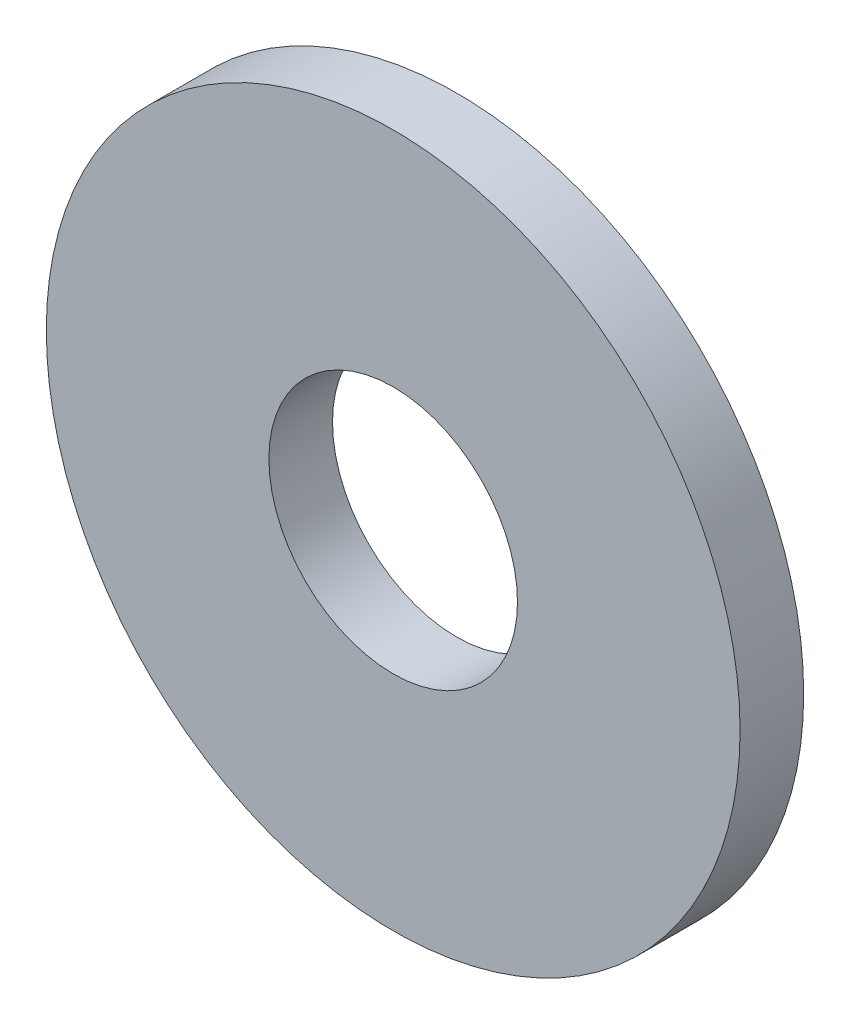
ISO-10303-21;
HEADER;
FILE_DESCRIPTION(('STEP AP214'),'2;1');
FILE_NAME('part.step','',(''),(''),'','','');
FILE_SCHEMA(('AUTOMOTIVE_DESIGN { 1 0 10303 214 1 1 1 1 }'));
ENDSEC;
DATA;
#1=APPLICATION_CONTEXT('core data for automotive mechanical design processes');
#2=APPLICATION_PROTOCOL_DEFINITION('international standard','automotive_design',2000,#1);
#3=PRODUCT_CONTEXT('',#1,'mechanical');
#4=PRODUCT('Part','Part','',(#3));
#5=PRODUCT_RELATED_PRODUCT_CATEGORY('part','',(#4));
#6=PRODUCT_DEFINITION_FORMATION('','',#4);
#7=PRODUCT_DEFINITION_CONTEXT('part definition',#1,'design');
#8=PRODUCT_DEFINITION('design','',#6,#7);
#9=PRODUCT_DEFINITION_SHAPE('','',#8);
#10=(LENGTH_UNIT() NAMED_UNIT(*) SI_UNIT(.MILLI.,.METRE.));
#11=(NAMED_UNIT(*) PLANE_ANGLE_UNIT() SI_UNIT($,.RADIAN.));
#12=(NAMED_UNIT(*) SI_UNIT($,.STERADIAN.) SOLID_ANGLE_UNIT());
#13=UNCERTAINTY_MEASURE_WITH_UNIT(LENGTH_MEASURE(1.E-05),#10,'distance_accuracy_value','');
#14=(GEOMETRIC_REPRESENTATION_CONTEXT(3) GLOBAL_UNCERTAINTY_ASSIGNED_CONTEXT((#13)) GLOBAL_UNIT_ASSIGNED_CONTEXT((#10,
#11,#12)) REPRESENTATION_CONTEXT('',''));
#15=CARTESIAN_POINT('',(0.,0.,0.));
#16=DIRECTION('',(0.,0.,1.));
#17=DIRECTION('',(1.,0.,0.));
#18=AXIS2_PLACEMENT_3D('',#15,#16,#17);
#19=CARTESIAN_POINT('',(0.,0.,1.1));
#20=DIRECTION('',(0.,0.,1.));
#21=DIRECTION('',(1.,0.,0.));
#22=AXIS2_PLACEMENT_3D('',#19,#20,#21);
#23=PLANE('',#22);
#24=CARTESIAN_POINT('',(0.,0.,1.1));
#25=DIRECTION('',(0.,0.,1.));
#26=DIRECTION('',(1.,0.,0.));
#27=AXIS2_PLACEMENT_3D('',#24,#25,#26);
#28=CIRCLE('',#27,6.);
#29=CARTESIAN_POINT('',(6.,0.,1.1));
#30=VERTEX_POINT('',#29);
#31=EDGE_CURVE('E10',#30,#30,#28,.T.);
#32=ORIENTED_EDGE('',*,*,#31,.T.);
#33=EDGE_LOOP('',(#32));
#34=FACE_BOUND('',#33,.T.);
#35=CARTESIAN_POINT('',(0.,0.,1.1));
#36=DIRECTION('',(0.,0.,1.));
#37=DIRECTION('',(1.,0.,0.));
#38=AXIS2_PLACEMENT_3D('',#35,#36,#37);
#39=CIRCLE('',#38,2.15);
#40=CARTESIAN_POINT('',(2.15,0.,1.1));
#41=VERTEX_POINT('',#40);
#42=EDGE_CURVE('E46',#41,#41,#39,.T.);
#43=ORIENTED_EDGE('',*,*,#42,.F.);
#44=EDGE_LOOP('',(#43));
#45=FACE_BOUND('',#44,.T.);
#46=ADVANCED_FACE('F35',(#34,#45),#23,.T.);
#47=CARTESIAN_POINT('',(0.,0.,0.));
#48=DIRECTION('',(0.,0.,1.));
#49=DIRECTION('',(1.,0.,0.));
#50=AXIS2_PLACEMENT_3D('',#47,#48,#49);
#51=PLANE('',#50);
#52=CARTESIAN_POINT('',(0.,0.,0.));
#53=DIRECTION('',(0.,0.,1.));
#54=DIRECTION('',(1.,0.,0.));
#55=AXIS2_PLACEMENT_3D('',#52,#53,#54);
#56=CIRCLE('',#55,6.);
#57=CARTESIAN_POINT('',(6.,0.,0.));
#58=VERTEX_POINT('',#57);
#59=EDGE_CURVE('E39',#58,#58,#56,.T.);
#60=ORIENTED_EDGE('',*,*,#59,.F.);
#61=EDGE_LOOP('',(#60));
#62=FACE_BOUND('',#61,.T.);
#63=CARTESIAN_POINT('',(0.,0.,0.));
#64=DIRECTION('',(0.,0.,1.));
#65=DIRECTION('',(1.,0.,0.));
#66=AXIS2_PLACEMENT_3D('',#63,#64,#65);
#67=CIRCLE('',#66,2.15);
#68=CARTESIAN_POINT('',(2.15,0.,0.));
#69=VERTEX_POINT('',#68);
#70=EDGE_CURVE('E48',#69,#69,#67,.T.);
#71=ORIENTED_EDGE('',*,*,#70,.T.);
#72=EDGE_LOOP('',(#71));
#73=FACE_BOUND('',#72,.T.);
#74=ADVANCED_FACE('F58',(#62,#73),#51,.F.);
#75=CARTESIAN_POINT('',(0.,0.,1.1));
#76=DIRECTION('',(0.,0.,-1.));
#77=DIRECTION('',(-1.,0.,0.));
#78=AXIS2_PLACEMENT_3D('',#75,#76,#77);
#79=CYLINDRICAL_SURFACE('',#78,6.);
#80=ORIENTED_EDGE('',*,*,#31,.F.);
#81=EDGE_LOOP('',(#80));
#82=FACE_BOUND('',#81,.T.);
#83=ORIENTED_EDGE('',*,*,#59,.T.);
#84=EDGE_LOOP('',(#83));
#85=FACE_BOUND('',#84,.T.);
#86=ADVANCED_FACE('F37',(#82,#85),#79,.T.);
#87=CARTESIAN_POINT('',(0.,0.,1.1));
#88=DIRECTION('',(0.,0.,-1.));
#89=DIRECTION('',(-1.,0.,0.));
#90=AXIS2_PLACEMENT_3D('',#87,#88,#89);
#91=CYLINDRICAL_SURFACE('',#90,2.15);
#92=ORIENTED_EDGE('',*,*,#42,.T.);
#93=EDGE_LOOP('',(#92));
#94=FACE_BOUND('',#93,.T.);
#95=ORIENTED_EDGE('',*,*,#70,.F.);
#96=EDGE_LOOP('',(#95));
#97=FACE_BOUND('',#96,.T.);
#98=ADVANCED_FACE('F54',(#94,#97),#91,.F.);
#99=CLOSED_SHELL('',(#46,#74,#86,#98));
#100=MANIFOLD_SOLID_BREP('B2',#99);
#101=ADVANCED_BREP_SHAPE_REPRESENTATION('',(#18,#100),#14);
#102=SHAPE_DEFINITION_REPRESENTATION(#9,#101);
ENDSEC;
END-ISO-10303-21;
